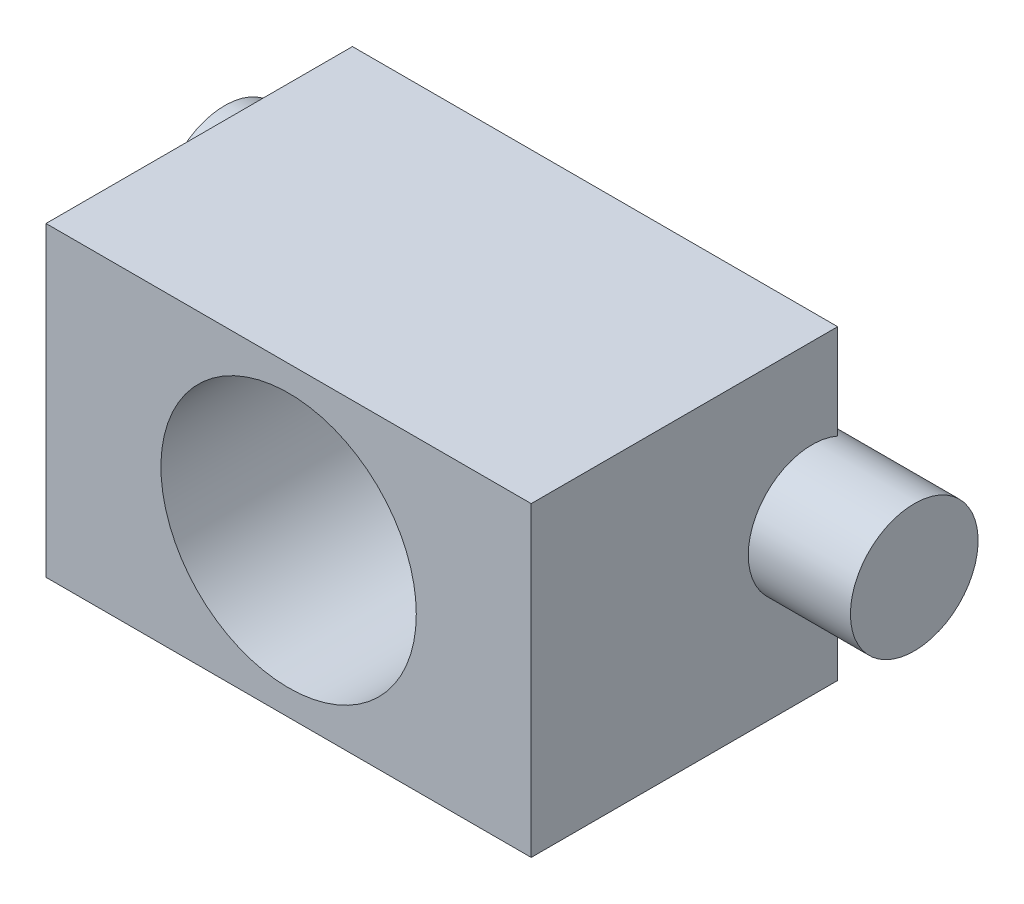
ISO-10303-21;
HEADER;
FILE_DESCRIPTION(('STEP AP214'),'2;1');
FILE_NAME('part.step','',(''),(''),'','','');
FILE_SCHEMA(('AUTOMOTIVE_DESIGN { 1 0 10303 214 1 1 1 1 }'));
ENDSEC;
DATA;
#1=APPLICATION_CONTEXT('core data for automotive mechanical design processes');
#2=APPLICATION_PROTOCOL_DEFINITION('international standard','automotive_design',2000,#1);
#3=PRODUCT_CONTEXT('',#1,'mechanical');
#4=PRODUCT('Part','Part','',(#3));
#5=PRODUCT_RELATED_PRODUCT_CATEGORY('part','',(#4));
#6=PRODUCT_DEFINITION_FORMATION('','',#4);
#7=PRODUCT_DEFINITION_CONTEXT('part definition',#1,'design');
#8=PRODUCT_DEFINITION('design','',#6,#7);
#9=PRODUCT_DEFINITION_SHAPE('','',#8);
#10=(LENGTH_UNIT() NAMED_UNIT(*) SI_UNIT(.MILLI.,.METRE.));
#11=(NAMED_UNIT(*) PLANE_ANGLE_UNIT() SI_UNIT($,.RADIAN.));
#12=(NAMED_UNIT(*) SI_UNIT($,.STERADIAN.) SOLID_ANGLE_UNIT());
#13=UNCERTAINTY_MEASURE_WITH_UNIT(LENGTH_MEASURE(1.E-05),#10,'distance_accuracy_value','');
#14=(GEOMETRIC_REPRESENTATION_CONTEXT(3) GLOBAL_UNCERTAINTY_ASSIGNED_CONTEXT((#13)) GLOBAL_UNIT_ASSIGNED_CONTEXT((#10,
#11,#12)) REPRESENTATION_CONTEXT('',''));
#15=CARTESIAN_POINT('',(0.,0.,0.));
#16=DIRECTION('',(0.,0.,1.));
#17=DIRECTION('',(1.,0.,0.));
#18=AXIS2_PLACEMENT_3D('',#15,#16,#17);
#19=CARTESIAN_POINT('',(0.,0.,0.));
#20=DIRECTION('',(0.,0.,-1.));
#21=DIRECTION('',(-1.,0.,0.));
#22=AXIS2_PLACEMENT_3D('',#19,#20,#21);
#23=PLANE('',#22);
#24=DIRECTION('',(-1.,0.,0.));
#25=VECTOR('',#24,1.);
#26=CARTESIAN_POINT('',(115.,18.5435607626104,0.));
#27=LINE('',#26,#25);
#28=CARTESIAN_POINT('',(95.,18.5435607626104,0.));
#29=VERTEX_POINT('',#28);
#30=CARTESIAN_POINT('',(69.720486043289,18.5435607626104,0.));
#31=VERTEX_POINT('',#30);
#32=EDGE_CURVE('E136',#29,#31,#27,.T.);
#33=ORIENTED_EDGE('',*,*,#32,.F.);
#34=DIRECTION('',(0.,1.,0.));
#35=VECTOR('',#34,1.);
#36=CARTESIAN_POINT('',(95.,0.,0.));
#37=LINE('',#36,#35);
#38=CARTESIAN_POINT('',(95.,0.,0.));
#39=VERTEX_POINT('',#38);
#40=EDGE_CURVE('E227',#39,#29,#37,.T.);
#41=ORIENTED_EDGE('',*,*,#40,.F.);
#42=DIRECTION('',(1.,0.,0.));
#43=VECTOR('',#42,1.);
#44=CARTESIAN_POINT('',(0.,0.,0.));
#45=LINE('',#44,#43);
#46=CARTESIAN_POINT('',(0.,0.,0.));
#47=VERTEX_POINT('',#46);
#48=EDGE_CURVE('E194',#47,#39,#45,.T.);
#49=ORIENTED_EDGE('',*,*,#48,.F.);
#50=DIRECTION('',(0.,-1.,0.));
#51=VECTOR('',#50,1.);
#52=CARTESIAN_POINT('',(0.,0.,0.));
#53=LINE('',#52,#51);
#54=CARTESIAN_POINT('',(0.,18.5435607626104,0.));
#55=VERTEX_POINT('',#54);
#56=EDGE_CURVE('E132',#55,#47,#53,.T.);
#57=ORIENTED_EDGE('',*,*,#56,.F.);
#58=CARTESIAN_POINT('',(25.279513956711,18.5435607626104,0.));
#59=VERTEX_POINT('',#58);
#60=EDGE_CURVE('E130',#59,#55,#27,.T.);
#61=ORIENTED_EDGE('',*,*,#60,.F.);
#62=CARTESIAN_POINT('',(47.5,30.,0.));
#63=DIRECTION('',(0.,0.,1.));
#64=DIRECTION('',(1.,0.,0.));
#65=AXIS2_PLACEMENT_3D('',#62,#63,#64);
#66=CIRCLE('',#65,25.);
#67=EDGE_CURVE('E118',#59,#31,#66,.T.);
#68=ORIENTED_EDGE('',*,*,#67,.T.);
#69=EDGE_LOOP('',(#33,#41,#49,#57,#61,#68));
#70=FACE_BOUND('',#69,.T.);
#71=ADVANCED_FACE('F45',(#70),#23,.T.);
#72=CARTESIAN_POINT('',(0.,0.,60.));
#73=DIRECTION('',(0.,0.,-1.));
#74=DIRECTION('',(-1.,0.,0.));
#75=AXIS2_PLACEMENT_3D('',#72,#73,#74);
#76=PLANE('',#75);
#77=DIRECTION('',(0.,-1.,0.));
#78=VECTOR('',#77,1.);
#79=CARTESIAN_POINT('',(0.,0.,60.));
#80=LINE('',#79,#78);
#81=CARTESIAN_POINT('',(0.,60.,60.));
#82=VERTEX_POINT('',#81);
#83=CARTESIAN_POINT('',(0.,0.,60.));
#84=VERTEX_POINT('',#83);
#85=EDGE_CURVE('E210',#82,#84,#80,.T.);
#86=ORIENTED_EDGE('',*,*,#85,.T.);
#87=DIRECTION('',(1.,0.,0.));
#88=VECTOR('',#87,1.);
#89=CARTESIAN_POINT('',(0.,0.,60.));
#90=LINE('',#89,#88);
#91=CARTESIAN_POINT('',(95.,0.,60.));
#92=VERTEX_POINT('',#91);
#93=EDGE_CURVE('E214',#84,#92,#90,.T.);
#94=ORIENTED_EDGE('',*,*,#93,.T.);
#95=DIRECTION('',(0.,1.,0.));
#96=VECTOR('',#95,1.);
#97=CARTESIAN_POINT('',(95.,0.,60.));
#98=LINE('',#97,#96);
#99=CARTESIAN_POINT('',(95.,60.,60.));
#100=VERTEX_POINT('',#99);
#101=EDGE_CURVE('E218',#92,#100,#98,.T.);
#102=ORIENTED_EDGE('',*,*,#101,.T.);
#103=DIRECTION('',(-1.,0.,0.));
#104=VECTOR('',#103,1.);
#105=CARTESIAN_POINT('',(0.,60.,60.));
#106=LINE('',#105,#104);
#107=EDGE_CURVE('E221',#100,#82,#106,.T.);
#108=ORIENTED_EDGE('',*,*,#107,.T.);
#109=EDGE_LOOP('',(#86,#94,#102,#108));
#110=FACE_BOUND('',#109,.T.);
#111=CARTESIAN_POINT('',(47.5,30.,60.));
#112=DIRECTION('',(0.,0.,1.));
#113=DIRECTION('',(1.,0.,0.));
#114=AXIS2_PLACEMENT_3D('',#111,#112,#113);
#115=CIRCLE('',#114,25.);
#116=CARTESIAN_POINT('',(72.5,30.,60.));
#117=VERTEX_POINT('',#116);
#118=EDGE_CURVE('E205',#117,#117,#115,.T.);
#119=ORIENTED_EDGE('',*,*,#118,.F.);
#120=EDGE_LOOP('',(#119));
#121=FACE_BOUND('',#120,.T.);
#122=ADVANCED_FACE('F167',(#110,#121),#76,.F.);
#123=DIRECTION('',(-1.,0.,0.));
#124=VECTOR('',#123,1.);
#125=CARTESIAN_POINT('',(115.,41.4564392373896,0.));
#126=LINE('',#125,#124);
#127=CARTESIAN_POINT('',(0.,41.4564392373896,0.));
#128=VERTEX_POINT('',#127);
#129=CARTESIAN_POINT('',(25.279513956711,41.4564392373896,0.));
#130=VERTEX_POINT('',#129);
#131=EDGE_CURVE('E75',#128,#130,#126,.F.);
#132=ORIENTED_EDGE('',*,*,#131,.F.);
#133=CARTESIAN_POINT('',(0.,60.,0.));
#134=VERTEX_POINT('',#133);
#135=EDGE_CURVE('E188',#134,#128,#53,.T.);
#136=ORIENTED_EDGE('',*,*,#135,.F.);
#137=DIRECTION('',(-1.,0.,0.));
#138=VECTOR('',#137,1.);
#139=CARTESIAN_POINT('',(0.,60.,0.));
#140=LINE('',#139,#138);
#141=CARTESIAN_POINT('',(95.,60.,0.));
#142=VERTEX_POINT('',#141);
#143=EDGE_CURVE('E215',#142,#134,#140,.T.);
#144=ORIENTED_EDGE('',*,*,#143,.F.);
#145=CARTESIAN_POINT('',(95.,41.4564392373896,0.));
#146=VERTEX_POINT('',#145);
#147=EDGE_CURVE('E226',#146,#142,#37,.T.);
#148=ORIENTED_EDGE('',*,*,#147,.F.);
#149=CARTESIAN_POINT('',(69.720486043289,41.4564392373896,0.));
#150=VERTEX_POINT('',#149);
#151=EDGE_CURVE('E197',#150,#146,#126,.F.);
#152=ORIENTED_EDGE('',*,*,#151,.F.);
#153=EDGE_CURVE('E126',#150,#130,#66,.T.);
#154=ORIENTED_EDGE('',*,*,#153,.T.);
#155=EDGE_LOOP('',(#132,#136,#144,#148,#152,#154));
#156=FACE_BOUND('',#155,.T.);
#157=ADVANCED_FACE('F169',(#156),#23,.T.);
#158=CARTESIAN_POINT('',(0.,0.,60.));
#159=DIRECTION('',(1.,0.,0.));
#160=DIRECTION('',(0.,0.,-1.));
#161=AXIS2_PLACEMENT_3D('',#158,#159,#160);
#162=PLANE('',#161);
#163=ORIENTED_EDGE('',*,*,#135,.T.);
#164=CARTESIAN_POINT('',(0.,30.,5.));
#165=DIRECTION('',(1.,0.,0.));
#166=DIRECTION('',(0.,0.,-1.));
#167=AXIS2_PLACEMENT_3D('',#164,#165,#166);
#168=CIRCLE('',#167,12.5);
#169=EDGE_CURVE('E67',#128,#55,#168,.T.);
#170=ORIENTED_EDGE('',*,*,#169,.T.);
#171=ORIENTED_EDGE('',*,*,#56,.T.);
#172=DIRECTION('',(0.,0.,-1.));
#173=VECTOR('',#172,1.);
#174=CARTESIAN_POINT('',(0.,0.,60.));
#175=LINE('',#174,#173);
#176=EDGE_CURVE('E140',#84,#47,#175,.T.);
#177=ORIENTED_EDGE('',*,*,#176,.F.);
#178=ORIENTED_EDGE('',*,*,#85,.F.);
#179=DIRECTION('',(0.,0.,-1.));
#180=VECTOR('',#179,1.);
#181=CARTESIAN_POINT('',(0.,60.,60.));
#182=LINE('',#181,#180);
#183=EDGE_CURVE('E191',#82,#134,#182,.T.);
#184=ORIENTED_EDGE('',*,*,#183,.T.);
#185=EDGE_LOOP('',(#163,#170,#171,#177,#178,#184));
#186=FACE_BOUND('',#185,.T.);
#187=ADVANCED_FACE('F47',(#186),#162,.F.);
#188=CARTESIAN_POINT('',(0.,0.,60.));
#189=DIRECTION('',(0.,1.,0.));
#190=DIRECTION('',(0.,0.,1.));
#191=AXIS2_PLACEMENT_3D('',#188,#189,#190);
#192=PLANE('',#191);
#193=ORIENTED_EDGE('',*,*,#48,.T.);
#194=DIRECTION('',(0.,0.,-1.));
#195=VECTOR('',#194,1.);
#196=CARTESIAN_POINT('',(95.,0.,60.));
#197=LINE('',#196,#195);
#198=EDGE_CURVE('E143',#92,#39,#197,.T.);
#199=ORIENTED_EDGE('',*,*,#198,.F.);
#200=ORIENTED_EDGE('',*,*,#93,.F.);
#201=ORIENTED_EDGE('',*,*,#176,.T.);
#202=EDGE_LOOP('',(#193,#199,#200,#201));
#203=FACE_BOUND('',#202,.T.);
#204=ADVANCED_FACE('F180',(#203),#192,.F.);
#205=CARTESIAN_POINT('',(95.,0.,60.));
#206=DIRECTION('',(-1.,0.,0.));
#207=DIRECTION('',(0.,0.,1.));
#208=AXIS2_PLACEMENT_3D('',#205,#206,#207);
#209=PLANE('',#208);
#210=ORIENTED_EDGE('',*,*,#40,.T.);
#211=CARTESIAN_POINT('',(95.,30.,5.));
#212=DIRECTION('',(-1.,0.,0.));
#213=DIRECTION('',(0.,0.,1.));
#214=AXIS2_PLACEMENT_3D('',#211,#212,#213);
#215=CIRCLE('',#214,12.5);
#216=EDGE_CURVE('E127',#29,#146,#215,.T.);
#217=ORIENTED_EDGE('',*,*,#216,.T.);
#218=ORIENTED_EDGE('',*,*,#147,.T.);
#219=DIRECTION('',(0.,0.,-1.));
#220=VECTOR('',#219,1.);
#221=CARTESIAN_POINT('',(95.,60.,60.));
#222=LINE('',#221,#220);
#223=EDGE_CURVE('E235',#100,#142,#222,.T.);
#224=ORIENTED_EDGE('',*,*,#223,.F.);
#225=ORIENTED_EDGE('',*,*,#101,.F.);
#226=ORIENTED_EDGE('',*,*,#198,.T.);
#227=EDGE_LOOP('',(#210,#217,#218,#224,#225,#226));
#228=FACE_BOUND('',#227,.T.);
#229=ADVANCED_FACE('F185',(#228),#209,.F.);
#230=CARTESIAN_POINT('',(0.,60.,60.));
#231=DIRECTION('',(0.,-1.,0.));
#232=DIRECTION('',(0.,0.,-1.));
#233=AXIS2_PLACEMENT_3D('',#230,#231,#232);
#234=PLANE('',#233);
#235=ORIENTED_EDGE('',*,*,#143,.T.);
#236=ORIENTED_EDGE('',*,*,#183,.F.);
#237=ORIENTED_EDGE('',*,*,#107,.F.);
#238=ORIENTED_EDGE('',*,*,#223,.T.);
#239=EDGE_LOOP('',(#235,#236,#237,#238));
#240=FACE_BOUND('',#239,.T.);
#241=ADVANCED_FACE('F254',(#240),#234,.F.);
#242=CARTESIAN_POINT('',(47.5,30.,60.));
#243=DIRECTION('',(0.,0.,-1.));
#244=DIRECTION('',(-1.,0.,0.));
#245=AXIS2_PLACEMENT_3D('',#242,#243,#244);
#246=CYLINDRICAL_SURFACE('',#245,25.);
#247=CARTESIAN_POINT('',(69.720486043289,18.5435607626104,0.));
#248=CARTESIAN_POINT('',(69.6565952748543,18.4196833229927,0.283772251386374));
#249=CARTESIAN_POINT('',(69.5967114986759,18.3060400720581,0.57298948709405));
#250=CARTESIAN_POINT('',(69.4864983231589,18.1000918244327,1.16085132217151));
#251=CARTESIAN_POINT('',(69.4361737605354,18.0077976246944,1.45950060526047));
#252=CARTESIAN_POINT('',(69.3466819061293,17.8455349104194,2.06450909614406));
#253=CARTESIAN_POINT('',(69.3075158993138,17.7755689669888,2.37086918746187));
#254=CARTESIAN_POINT('',(69.2416353108159,17.6587755571205,2.9892416919771));
#255=CARTESIAN_POINT('',(69.2149183841175,17.6119437328407,3.30125302914427));
#256=CARTESIAN_POINT('',(69.1747902719618,17.5418657583195,3.92984496987939));
#257=CARTESIAN_POINT('',(69.1614242547363,17.5186996670197,4.24643743286625));
#258=CARTESIAN_POINT('',(69.1486411545805,17.4965402930635,4.88077064017079));
#259=CARTESIAN_POINT('',(69.1492248860106,17.4975484216534,5.1985114504442));
#260=CARTESIAN_POINT('',(69.1643129179247,17.52371175986,5.83229270340959));
#261=CARTESIAN_POINT('',(69.1788011872467,17.5488391612968,6.14833468282503));
#262=CARTESIAN_POINT('',(69.2211505886078,17.6228667797883,6.77669764588728));
#263=CARTESIAN_POINT('',(69.2490113834065,17.6717663973342,7.08901872316763));
#264=CARTESIAN_POINT('',(69.3159567013041,17.7906387116589,7.69706047328028));
#265=CARTESIAN_POINT('',(69.3546207030104,17.8598259213781,7.99298206660846));
#266=CARTESIAN_POINT('',(69.4423365770178,18.0190934016183,8.5776698789186));
#267=CARTESIAN_POINT('',(69.4913920808056,18.1091809771774,8.86643355693634));
#268=CARTESIAN_POINT('',(69.5985053419381,18.3094504187129,9.43531654663595));
#269=CARTESIAN_POINT('',(69.6565670626853,18.4196411353394,9.71543198706387));
#270=CARTESIAN_POINT('',(69.7801699580608,18.6592680758736,10.2657301236758));
#271=CARTESIAN_POINT('',(69.845714484034,18.7887129311102,10.5359082970378));
#272=CARTESIAN_POINT('',(69.988665223325,19.078086263983,11.0882951281076));
#273=CARTESIAN_POINT('',(70.0666075158939,19.2396911345338,11.3694872795007));
#274=CARTESIAN_POINT('',(70.2273671057836,19.5835323644543,11.9175039912593));
#275=CARTESIAN_POINT('',(70.310184822854,19.7657705014947,12.1843273107431));
#276=CARTESIAN_POINT('',(70.4786787783742,20.1499079977986,12.7025806913409));
#277=CARTESIAN_POINT('',(70.5643557814057,20.3518126440915,12.9540065833485));
#278=CARTESIAN_POINT('',(70.7365743462019,20.774293498981,13.4403866863731));
#279=CARTESIAN_POINT('',(70.8231160358473,20.9948725065315,13.6753384185248));
#280=CARTESIAN_POINT('',(71.004856032402,21.4796662178906,14.1532770312082));
#281=CARTESIAN_POINT('',(71.0999278495783,21.7459953889865,14.3941732869318));
#282=CARTESIAN_POINT('',(71.2861602530865,22.2991102415653,14.8526795902074));
#283=CARTESIAN_POINT('',(71.3773221563865,22.5858889470268,15.0702975160411));
#284=CARTESIAN_POINT('',(71.5533525193128,23.1785771602213,15.480847824371));
#285=CARTESIAN_POINT('',(71.6382191839865,23.4844920787542,15.6737731775971));
#286=CARTESIAN_POINT('',(71.7993026883775,24.1136340762631,16.0332193624848));
#287=CARTESIAN_POINT('',(71.8755199680431,24.4368602734739,16.1997415373076));
#288=CARTESIAN_POINT('',(72.0160104201013,25.0932645449411,16.5022792605864));
#289=CARTESIAN_POINT('',(72.0804558763463,25.4261991679426,16.6387421126574));
#290=CARTESIAN_POINT('',(72.1970411373877,26.1045453711796,16.8829863939474));
#291=CARTESIAN_POINT('',(72.2491809125692,26.4499569814399,16.9907677541419));
#292=CARTESIAN_POINT('',(72.3395587150946,27.150285036711,17.1762158775858));
#293=CARTESIAN_POINT('',(72.3778071595695,27.5051941441919,17.2539052098146));
#294=CARTESIAN_POINT('',(72.4392628777815,28.2216883865721,17.3781971588973));
#295=CARTESIAN_POINT('',(72.4624717833187,28.5832727928171,17.4248031483306));
#296=CARTESIAN_POINT('',(72.4915774976127,29.2733003647777,17.4831685078498));
#297=CARTESIAN_POINT('',(72.4989779016534,29.6014279210579,17.4979554945779));
#298=CARTESIAN_POINT('',(72.5008240755082,30.25785161561,17.5016484573712));
#299=CARTESIAN_POINT('',(72.4952708145466,30.5861477394318,17.4905563697709));
#300=CARTESIAN_POINT('',(72.4713576172664,31.2403360872609,17.4426334950088));
#301=CARTESIAN_POINT('',(72.4529992676643,31.5662286040508,17.4058058968094));
#302=CARTESIAN_POINT('',(72.4039549325642,32.2132049350553,17.3068605340622));
#303=CARTESIAN_POINT('',(72.3732689039912,32.5342887324633,17.2447426811457));
#304=CARTESIAN_POINT('',(72.3016914916602,33.157674516535,17.098669092329));
#305=CARTESIAN_POINT('',(72.2612166122475,33.4602330855389,17.0155998226383));
#306=CARTESIAN_POINT('',(72.1704797154386,34.0569072063054,16.8274830701559));
#307=CARTESIAN_POINT('',(72.1202180508059,34.3510230619463,16.7224363795274));
#308=CARTESIAN_POINT('',(72.0110136587358,34.9291747121058,16.4913080251086));
#309=CARTESIAN_POINT('',(71.9520712702659,35.213210899681,16.3652271826404));
#310=CARTESIAN_POINT('',(71.8267284816726,35.7698986228641,16.0929852403947));
#311=CARTESIAN_POINT('',(71.7603252380127,36.0425457631148,15.946816479792));
#312=CARTESIAN_POINT('',(71.6166923472027,36.5932969588619,15.6248297559067));
#313=CARTESIAN_POINT('',(71.539033159795,36.8705043650208,15.4476693799675));
#314=CARTESIAN_POINT('',(71.3784938359022,37.4092227558984,15.0727934166132));
#315=CARTESIAN_POINT('',(71.2956113824112,37.6707266727696,14.8750686813309));
#316=CARTESIAN_POINT('',(71.1264681286196,38.176871721519,14.4602261225034));
#317=CARTESIAN_POINT('',(71.0402060681818,38.4215064678061,14.2431010258452));
#318=CARTESIAN_POINT('',(70.866252194685,38.8927701049083,13.7906403154522));
#319=CARTESIAN_POINT('',(70.7785603135791,39.1193981357281,13.5553038330054));
#320=CARTESIAN_POINT('',(70.5954475210077,39.5742341553333,13.0443668842093));
#321=CARTESIAN_POINT('',(70.5000816844449,39.8005566208135,12.7670642222273));
#322=CARTESIAN_POINT('',(70.3127110216757,40.2291219706352,12.1932825494509));
#323=CARTESIAN_POINT('',(70.2207068130101,40.4313604459408,11.8968000427026));
#324=CARTESIAN_POINT('',(70.0428366043412,40.8103823572458,11.28608138314));
#325=CARTESIAN_POINT('',(69.9569724813537,40.9871580259086,10.9718398535303));
#326=CARTESIAN_POINT('',(69.7942908216475,41.313613996258,10.3275215118827));
#327=CARTESIAN_POINT('',(69.7174686942054,41.4633080684917,9.99745285630619));
#328=CARTESIAN_POINT('',(69.5764290611232,41.7326101965424,9.32721301959869));
#329=CARTESIAN_POINT('',(69.5120766689621,41.8525446733753,8.98720182111827));
#330=CARTESIAN_POINT('',(69.3974112567562,42.0630751201132,8.29586963901514));
#331=CARTESIAN_POINT('',(69.3470982492037,42.1536710639126,7.94454864532925));
#332=CARTESIAN_POINT('',(69.2627215916419,42.3041214243012,7.23390545160984));
#333=CARTESIAN_POINT('',(69.2286377913656,42.3640139695083,6.87459375642533));
#334=CARTESIAN_POINT('',(69.1782009875654,42.4522377078185,6.1509066495965));
#335=CARTESIAN_POINT('',(69.1618449546016,42.4805742934386,5.78653211390658));
#336=CARTESIAN_POINT('',(69.1485216952353,42.503663912534,5.10224869098888));
#337=CARTESIAN_POINT('',(69.1493775067896,42.5021875877452,4.78250228862438));
#338=CARTESIAN_POINT('',(69.1651873692921,42.4747711863086,4.14440386669671));
#339=CARTESIAN_POINT('',(69.1801413210106,42.4488312818477,3.82605183733508));
#340=CARTESIAN_POINT('',(69.2236021888556,42.3728336367072,3.19318472487073));
#341=CARTESIAN_POINT('',(69.2521095238844,42.3227751505801,2.87866976067056));
#342=CARTESIAN_POINT('',(69.3216590367484,42.1991883407959,2.25580801331728));
#343=CARTESIAN_POINT('',(69.3626974210791,42.1256671196715,1.94745939349527));
#344=CARTESIAN_POINT('',(69.4525395749339,41.9621939875449,1.36109220562793));
#345=CARTESIAN_POINT('',(69.500556030546,41.8738367615058,1.08250460345765));
#346=CARTESIAN_POINT('',(69.6047327657048,41.6787321327834,0.534387465887206));
#347=CARTESIAN_POINT('',(69.6608677882308,41.5720415785513,0.264832919645485));
#348=CARTESIAN_POINT('',(69.720486043289,41.4564392373896,0.));
#349=B_SPLINE_CURVE_WITH_KNOTS('',3,(#247,#248,#249,#250,#251,#252,#253,#254,#255,#256,#257,
#258,#259,#260,#261,#262,#263,#264,#265,#266,#267,#268,#269,#270,#271,#272,#273,#274,#275,#276,
#277,#278,#279,#280,#281,#282,#283,#284,#285,#286,#287,#288,#289,#290,#291,#292,#293,#294,#295,
#296,#297,#298,#299,#300,#301,#302,#303,#304,#305,#306,#307,#308,#309,#310,#311,#312,#313,#314,
#315,#316,#317,#318,#319,#320,#321,#322,#323,#324,#325,#326,#327,#328,#329,#330,#331,#332,#333,
#334,#335,#336,#337,#338,#339,#340,#341,#342,#343,#344,#345,#346,#347,#348),.UNSPECIFIED.,.F.,
.F.,(4,2,2,2,2,2,2,2,2,2,2,2,2,2,2,2,2,2,2,2,2,2,2,2,2,2,2,2,2,2,2,2,2,2,2,2,2,2,2,2,2,2,2,2,2,
2,2,2,2,2,4),(0.,0.948332723465164,1.89714400804308,2.84606450916494,3.79480619110379,
4.74674685346436,5.69874308849116,6.64964304153459,7.6005190151827,8.51857953634045,
9.43696142017744,10.3557486127298,11.2749489314896,12.274595496714,13.2743282526845,
14.2743305166614,15.2744829294069,16.3876192214402,17.5003775854192,18.6134520186789,
19.7264698103355,20.8215985020249,21.9167298292199,23.0110382116782,24.1052278410601,
25.0896118321136,26.0739221715595,27.0581105638539,28.042302395101,28.9903240595206,
29.9383115589359,30.8862620508652,31.8345750661715,32.8475828593613,33.8610432229748,
34.8748851356258,35.8887754399875,36.9987479527699,38.1089233559325,39.2194367001073,
40.3293837695606,41.4265569126267,42.5237310319576,43.6195393189845,44.7151603173926,
45.6731892258901,46.6312113913488,47.5892631688733,48.5470252039745,49.4347490134662,
50.3197682447868),.UNSPECIFIED.);
#350=EDGE_CURVE('E11',#31,#150,#349,.T.);
#351=ORIENTED_EDGE('',*,*,#350,.F.);
#352=ORIENTED_EDGE('',*,*,#67,.F.);
#353=CARTESIAN_POINT('',(25.279513956711,41.4564392373896,0.));
#354=CARTESIAN_POINT('',(25.3434047251457,41.5803166770073,0.283772251386376));
#355=CARTESIAN_POINT('',(25.4032885013241,41.6939599279419,0.572989487094051));
#356=CARTESIAN_POINT('',(25.5135016768411,41.8999081755673,1.16085132217151));
#357=CARTESIAN_POINT('',(25.5638262394646,41.9922023753056,1.45950060526048));
#358=CARTESIAN_POINT('',(25.6533180938707,42.1544650895806,2.06450909614406));
#359=CARTESIAN_POINT('',(25.6924841006862,42.2244310330112,2.37086918746187));
#360=CARTESIAN_POINT('',(25.7583646891841,42.3412244428794,2.9892416919771));
#361=CARTESIAN_POINT('',(25.7850816158825,42.3880562671593,3.30125302914427));
#362=CARTESIAN_POINT('',(25.8252097280382,42.4581342416804,3.9298449698794));
#363=CARTESIAN_POINT('',(25.8385757452637,42.4813003329803,4.24643743286625));
#364=CARTESIAN_POINT('',(25.8513588454195,42.5034597069365,4.88077064017079));
#365=CARTESIAN_POINT('',(25.8507751139894,42.5024515783466,5.1985114504442));
#366=CARTESIAN_POINT('',(25.8356870820753,42.47628824014,5.83229270340959));
#367=CARTESIAN_POINT('',(25.8211988127533,42.4511608387032,6.14833468282503));
#368=CARTESIAN_POINT('',(25.7788494113922,42.3771332202117,6.77669764588728));
#369=CARTESIAN_POINT('',(25.7509886165935,42.3282336026658,7.08901872316763));
#370=CARTESIAN_POINT('',(25.6840432986959,42.2093612883411,7.69706047328028));
#371=CARTESIAN_POINT('',(25.6453792969896,42.1401740786219,7.99298206660846));
#372=CARTESIAN_POINT('',(25.5576634229822,41.9809065983817,8.5776698789186));
#373=CARTESIAN_POINT('',(25.5086079191944,41.8908190228226,8.86643355693634));
#374=CARTESIAN_POINT('',(25.4014946580619,41.6905495812871,9.43531654663595));
#375=CARTESIAN_POINT('',(25.3434329373147,41.5803588646606,9.71543198706387));
#376=CARTESIAN_POINT('',(25.2198300419392,41.3407319241264,10.2657301236758));
#377=CARTESIAN_POINT('',(25.154285515966,41.2112870688898,10.5359082970378));
#378=CARTESIAN_POINT('',(25.011334776675,40.921913736017,11.0882951281076));
#379=CARTESIAN_POINT('',(24.9333924841061,40.7603088654662,11.3694872795007));
#380=CARTESIAN_POINT('',(24.7726328942164,40.4164676355457,11.9175039912593));
#381=CARTESIAN_POINT('',(24.689815177146,40.2342294985053,12.1843273107431));
#382=CARTESIAN_POINT('',(24.5213212216258,39.8500920022014,12.7025806913409));
#383=CARTESIAN_POINT('',(24.4356442185943,39.6481873559085,12.9540065833485));
#384=CARTESIAN_POINT('',(24.2634256537981,39.225706501019,13.4403866863731));
#385=CARTESIAN_POINT('',(24.1768839641527,39.0051274934685,13.6753384185249));
#386=CARTESIAN_POINT('',(23.995143967598,38.5203337821094,14.1532770312082));
#387=CARTESIAN_POINT('',(23.9000721504217,38.2540046110135,14.3941732869318));
#388=CARTESIAN_POINT('',(23.7138397469135,37.7008897584347,14.8526795902074));
#389=CARTESIAN_POINT('',(23.6226778436135,37.4141110529732,15.0702975160411));
#390=CARTESIAN_POINT('',(23.4466474806872,36.8214228397787,15.480847824371));
#391=CARTESIAN_POINT('',(23.3617808160135,36.5155079212458,15.6737731775971));
#392=CARTESIAN_POINT('',(23.2006973116226,35.8863659237369,16.0332193624848));
#393=CARTESIAN_POINT('',(23.1244800319569,35.5631397265261,16.1997415373076));
#394=CARTESIAN_POINT('',(22.9839895798987,34.9067354550589,16.5022792605864));
#395=CARTESIAN_POINT('',(22.9195441236537,34.5738008320574,16.6387421126574));
#396=CARTESIAN_POINT('',(22.8029588626123,33.8954546288204,16.8829863939474));
#397=CARTESIAN_POINT('',(22.7508190874308,33.5500430185601,16.9907677541419));
#398=CARTESIAN_POINT('',(22.6604412849054,32.849714963289,17.1762158775858));
#399=CARTESIAN_POINT('',(22.6221928404305,32.4948058558081,17.2539052098146));
#400=CARTESIAN_POINT('',(22.5607371222185,31.7783116134279,17.3781971588973));
#401=CARTESIAN_POINT('',(22.5375282166813,31.4167272071829,17.4248031483306));
#402=CARTESIAN_POINT('',(22.5084225023873,30.7266996352223,17.4831685078498));
#403=CARTESIAN_POINT('',(22.5010220983466,30.3985720789421,17.4979554945779));
#404=CARTESIAN_POINT('',(22.4991759244918,29.74214838439,17.5016484573712));
#405=CARTESIAN_POINT('',(22.5047291854534,29.4138522605682,17.4905563697709));
#406=CARTESIAN_POINT('',(22.5286423827336,28.7596639127391,17.4426334950088));
#407=CARTESIAN_POINT('',(22.5470007323357,28.4337713959492,17.4058058968094));
#408=CARTESIAN_POINT('',(22.5960450674358,27.7867950649447,17.3068605340622));
#409=CARTESIAN_POINT('',(22.6267310960088,27.4657112675367,17.2447426811458));
#410=CARTESIAN_POINT('',(22.6983085083398,26.842325483465,17.098669092329));
#411=CARTESIAN_POINT('',(22.7387833877525,26.5397669144611,17.0155998226383));
#412=CARTESIAN_POINT('',(22.8295202845614,25.9430927936946,16.8274830701559));
#413=CARTESIAN_POINT('',(22.8797819491941,25.6489769380537,16.7224363795274));
#414=CARTESIAN_POINT('',(22.9889863412642,25.0708252878942,16.4913080251086));
#415=CARTESIAN_POINT('',(23.0479287297341,24.786789100319,16.3652271826404));
#416=CARTESIAN_POINT('',(23.1732715183274,24.2301013771359,16.0929852403947));
#417=CARTESIAN_POINT('',(23.2396747619873,23.9574542368852,15.946816479792));
#418=CARTESIAN_POINT('',(23.3833076527973,23.4067030411381,15.6248297559067));
#419=CARTESIAN_POINT('',(23.460966840205,23.1294956349793,15.4476693799676));
#420=CARTESIAN_POINT('',(23.6215061640978,22.5907772441016,15.0727934166132));
#421=CARTESIAN_POINT('',(23.7043886175889,22.3292733272304,14.8750686813309));
#422=CARTESIAN_POINT('',(23.8735318713804,21.823128278481,14.4602261225034));
#423=CARTESIAN_POINT('',(23.9597939318182,21.5784935321939,14.2431010258452));
#424=CARTESIAN_POINT('',(24.133747805315,21.1072298950917,13.7906403154522));
#425=CARTESIAN_POINT('',(24.2214396864209,20.8806018642719,13.5553038330054));
#426=CARTESIAN_POINT('',(24.4045524789923,20.4257658446667,13.0443668842093));
#427=CARTESIAN_POINT('',(24.4999183155551,20.1994433791865,12.7670642222273));
#428=CARTESIAN_POINT('',(24.6872889783243,19.7708780293648,12.1932825494509));
#429=CARTESIAN_POINT('',(24.7792931869899,19.5686395540592,11.8968000427026));
#430=CARTESIAN_POINT('',(24.9571633956588,19.1896176427542,11.28608138314));
#431=CARTESIAN_POINT('',(25.0430275186463,19.0128419740914,10.9718398535303));
#432=CARTESIAN_POINT('',(25.2057091783525,18.686386003742,10.3275215118827));
#433=CARTESIAN_POINT('',(25.2825313057946,18.5366919315083,9.99745285630619));
#434=CARTESIAN_POINT('',(25.4235709388768,18.2673898034576,9.3272130195987));
#435=CARTESIAN_POINT('',(25.4879233310379,18.1474553266247,8.98720182111828));
#436=CARTESIAN_POINT('',(25.6025887432438,17.9369248798869,8.29586963901515));
#437=CARTESIAN_POINT('',(25.6529017507963,17.8463289360874,7.94454864532926));
#438=CARTESIAN_POINT('',(25.7372784083581,17.6958785756989,7.23390545160985));
#439=CARTESIAN_POINT('',(25.7713622086344,17.6359860304917,6.87459375642533));
#440=CARTESIAN_POINT('',(25.8217990124346,17.5477622921815,6.1509066495965));
#441=CARTESIAN_POINT('',(25.8381550453984,17.5194257065614,5.78653211390658));
#442=CARTESIAN_POINT('',(25.8514783047647,17.496336087466,5.10224869098888));
#443=CARTESIAN_POINT('',(25.8506224932104,17.4978124122548,4.78250228862439));
#444=CARTESIAN_POINT('',(25.8348126307079,17.5252288136914,4.14440386669672));
#445=CARTESIAN_POINT('',(25.8198586789895,17.5511687181523,3.82605183733509));
#446=CARTESIAN_POINT('',(25.7763978111444,17.6271663632928,3.19318472487073));
#447=CARTESIAN_POINT('',(25.7478904761156,17.6772248494199,2.87866976067057));
#448=CARTESIAN_POINT('',(25.6783409632516,17.8008116592041,2.25580801331728));
#449=CARTESIAN_POINT('',(25.6373025789209,17.8743328803285,1.94745939349527));
#450=CARTESIAN_POINT('',(25.5474604250661,18.0378060124551,1.36109220562793));
#451=CARTESIAN_POINT('',(25.4994439694541,18.1261632384942,1.08250460345765));
#452=CARTESIAN_POINT('',(25.3952672342953,18.3212678672166,0.534387465887208));
#453=CARTESIAN_POINT('',(25.3391322117692,18.4279584214487,0.264832919645487));
#454=CARTESIAN_POINT('',(25.279513956711,18.5435607626104,0.));
#455=B_SPLINE_CURVE_WITH_KNOTS('',3,(#353,#354,#355,#356,#357,#358,#359,#360,#361,#362,#363,
#364,#365,#366,#367,#368,#369,#370,#371,#372,#373,#374,#375,#376,#377,#378,#379,#380,#381,#382,
#383,#384,#385,#386,#387,#388,#389,#390,#391,#392,#393,#394,#395,#396,#397,#398,#399,#400,#401,
#402,#403,#404,#405,#406,#407,#408,#409,#410,#411,#412,#413,#414,#415,#416,#417,#418,#419,#420,
#421,#422,#423,#424,#425,#426,#427,#428,#429,#430,#431,#432,#433,#434,#435,#436,#437,#438,#439,
#440,#441,#442,#443,#444,#445,#446,#447,#448,#449,#450,#451,#452,#453,#454),.UNSPECIFIED.,.F.,
.F.,(4,2,2,2,2,2,2,2,2,2,2,2,2,2,2,2,2,2,2,2,2,2,2,2,2,2,2,2,2,2,2,2,2,2,2,2,2,2,2,2,2,2,2,2,2,
2,2,2,2,2,4),(0.,0.948332723465163,1.89714400804309,2.84606450916494,3.79480619110379,
4.74674685346436,5.69874308849116,6.64964304153459,7.6005190151827,8.51857953634045,
9.43696142017744,10.3557486127298,11.2749489314896,12.274595496714,13.2743282526845,
14.2743305166614,15.2744829294069,16.3876192214402,17.5003775854192,18.6134520186789,
19.7264698103355,20.8215985020249,21.9167298292199,23.0110382116782,24.1052278410601,
25.0896118321136,26.0739221715595,27.0581105638539,28.042302395101,28.9903240595206,
29.9383115589359,30.8862620508652,31.8345750661715,32.8475828593613,33.8610432229748,
34.8748851356258,35.8887754399875,36.9987479527699,38.1089233559325,39.2194367001073,
40.3293837695606,41.4265569126267,42.5237310319576,43.6195393189845,44.7151603173926,
45.6731892258901,46.6312113913488,47.5892631688733,48.5470252039745,49.4347490134662,
50.3197682447868),.UNSPECIFIED.);
#456=EDGE_CURVE('E60',#130,#59,#455,.T.);
#457=ORIENTED_EDGE('',*,*,#456,.F.);
#458=ORIENTED_EDGE('',*,*,#153,.F.);
#459=EDGE_LOOP('',(#351,#352,#457,#458));
#460=FACE_BOUND('',#459,.T.);
#461=ORIENTED_EDGE('',*,*,#118,.T.);
#462=EDGE_LOOP('',(#461));
#463=FACE_BOUND('',#462,.T.);
#464=ADVANCED_FACE('F120',(#460,#463),#246,.F.);
#465=CARTESIAN_POINT('',(115.,30.,5.));
#466=DIRECTION('',(-1.,0.,0.));
#467=DIRECTION('',(0.,0.,1.));
#468=AXIS2_PLACEMENT_3D('',#465,#466,#467);
#469=CYLINDRICAL_SURFACE('',#468,12.5);
#470=ORIENTED_EDGE('',*,*,#169,.F.);
#471=ORIENTED_EDGE('',*,*,#131,.T.);
#472=ORIENTED_EDGE('',*,*,#456,.T.);
#473=ORIENTED_EDGE('',*,*,#60,.T.);
#474=EDGE_LOOP('',(#470,#471,#472,#473));
#475=FACE_BOUND('',#474,.T.);
#476=CARTESIAN_POINT('',(115.,30.,5.));
#477=DIRECTION('',(-1.,0.,0.));
#478=DIRECTION('',(0.,0.,1.));
#479=AXIS2_PLACEMENT_3D('',#476,#477,#478);
#480=CIRCLE('',#479,12.5);
#481=CARTESIAN_POINT('',(115.,30.,17.5));
#482=VERTEX_POINT('',#481);
#483=EDGE_CURVE('E320',#482,#482,#480,.T.);
#484=ORIENTED_EDGE('',*,*,#483,.T.);
#485=EDGE_LOOP('',(#484));
#486=FACE_BOUND('',#485,.T.);
#487=CARTESIAN_POINT('',(-20.,30.,5.));
#488=DIRECTION('',(-1.,0.,0.));
#489=DIRECTION('',(0.,0.,1.));
#490=AXIS2_PLACEMENT_3D('',#487,#488,#489);
#491=CIRCLE('',#490,12.5);
#492=CARTESIAN_POINT('',(-20.,30.,17.5));
#493=VERTEX_POINT('',#492);
#494=EDGE_CURVE('E324',#493,#493,#491,.T.);
#495=ORIENTED_EDGE('',*,*,#494,.F.);
#496=EDGE_LOOP('',(#495));
#497=FACE_BOUND('',#496,.T.);
#498=ORIENTED_EDGE('',*,*,#216,.F.);
#499=ORIENTED_EDGE('',*,*,#32,.T.);
#500=ORIENTED_EDGE('',*,*,#350,.T.);
#501=ORIENTED_EDGE('',*,*,#151,.T.);
#502=EDGE_LOOP('',(#498,#499,#500,#501));
#503=FACE_BOUND('',#502,.T.);
#504=ADVANCED_FACE('F137',(#475,#486,#497,#503),#469,.T.);
#505=CARTESIAN_POINT('',(115.,30.,5.));
#506=DIRECTION('',(-1.,0.,0.));
#507=DIRECTION('',(0.,0.,1.));
#508=AXIS2_PLACEMENT_3D('',#505,#506,#507);
#509=PLANE('',#508);
#510=ORIENTED_EDGE('',*,*,#483,.F.);
#511=EDGE_LOOP('',(#510));
#512=FACE_BOUND('',#511,.T.);
#513=ADVANCED_FACE('F155',(#512),#509,.F.);
#514=CARTESIAN_POINT('',(-20.,30.,5.));
#515=DIRECTION('',(-1.,0.,0.));
#516=DIRECTION('',(0.,0.,1.));
#517=AXIS2_PLACEMENT_3D('',#514,#515,#516);
#518=PLANE('',#517);
#519=ORIENTED_EDGE('',*,*,#494,.T.);
#520=EDGE_LOOP('',(#519));
#521=FACE_BOUND('',#520,.T.);
#522=ADVANCED_FACE('F159',(#521),#518,.T.);
#523=CLOSED_SHELL('',(#71,#122,#157,#187,#204,#229,#241,#464,#504,#513,#522));
#524=MANIFOLD_SOLID_BREP('B2',#523);
#525=ADVANCED_BREP_SHAPE_REPRESENTATION('',(#18,#524),#14);
#526=SHAPE_DEFINITION_REPRESENTATION(#9,#525);
ENDSEC;
END-ISO-10303-21;
